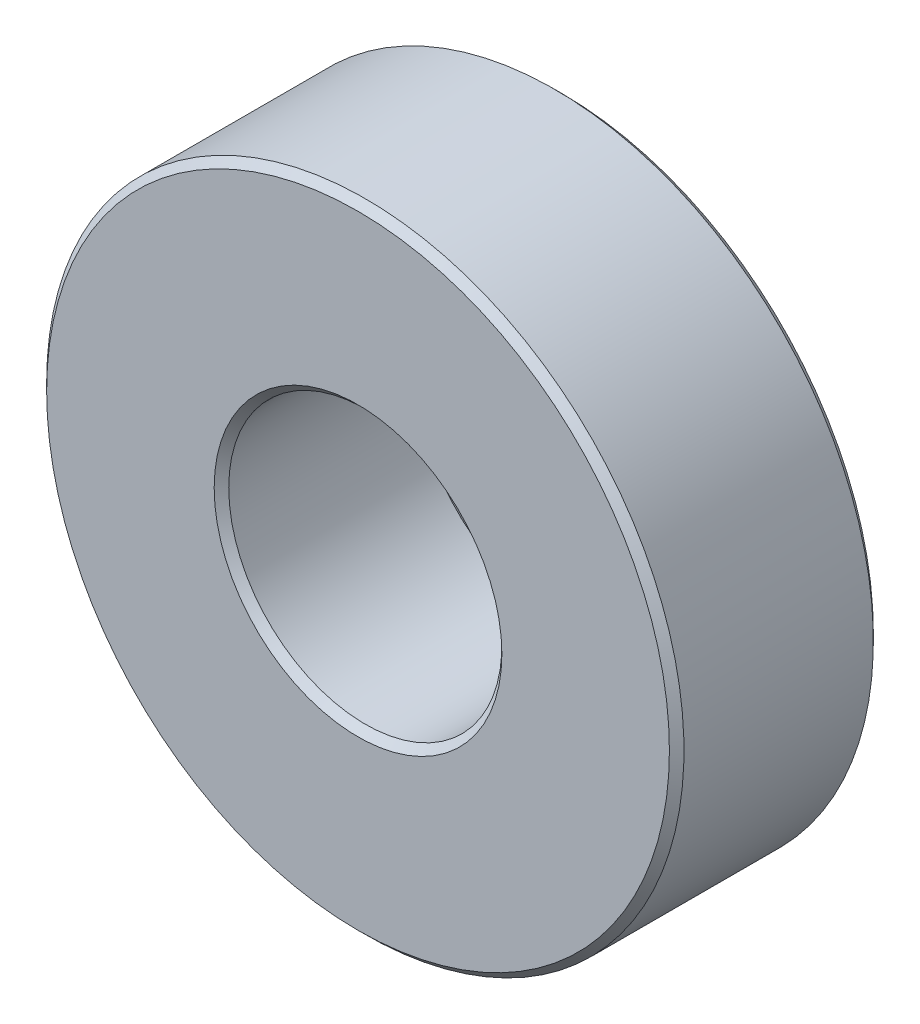
ISO-10303-21;
HEADER;
FILE_DESCRIPTION(('STEP AP214'),'2;1');
FILE_NAME('part.step','',(''),(''),'','','');
FILE_SCHEMA(('AUTOMOTIVE_DESIGN { 1 0 10303 214 1 1 1 1 }'));
ENDSEC;
DATA;
#1=APPLICATION_CONTEXT('core data for automotive mechanical design processes');
#2=APPLICATION_PROTOCOL_DEFINITION('international standard','automotive_design',2000,#1);
#3=PRODUCT_CONTEXT('',#1,'mechanical');
#4=PRODUCT('Part','Part','',(#3));
#5=PRODUCT_RELATED_PRODUCT_CATEGORY('part','',(#4));
#6=PRODUCT_DEFINITION_FORMATION('','',#4);
#7=PRODUCT_DEFINITION_CONTEXT('part definition',#1,'design');
#8=PRODUCT_DEFINITION('design','',#6,#7);
#9=PRODUCT_DEFINITION_SHAPE('','',#8);
#10=(LENGTH_UNIT() NAMED_UNIT(*) SI_UNIT(.MILLI.,.METRE.));
#11=(NAMED_UNIT(*) PLANE_ANGLE_UNIT() SI_UNIT($,.RADIAN.));
#12=(NAMED_UNIT(*) SI_UNIT($,.STERADIAN.) SOLID_ANGLE_UNIT());
#13=UNCERTAINTY_MEASURE_WITH_UNIT(LENGTH_MEASURE(1.E-05),#10,'distance_accuracy_value','');
#14=(GEOMETRIC_REPRESENTATION_CONTEXT(3) GLOBAL_UNCERTAINTY_ASSIGNED_CONTEXT((#13)) GLOBAL_UNIT_ASSIGNED_CONTEXT((#10,
#11,#12)) REPRESENTATION_CONTEXT('',''));
#15=CARTESIAN_POINT('',(0.,0.,0.));
#16=DIRECTION('',(0.,0.,1.));
#17=DIRECTION('',(1.,0.,0.));
#18=AXIS2_PLACEMENT_3D('',#15,#16,#17);
#19=CARTESIAN_POINT('',(0.,0.,7.112));
#20=DIRECTION('',(0.,0.,-1.));
#21=DIRECTION('',(-1.,0.,0.));
#22=AXIS2_PLACEMENT_3D('',#19,#20,#21);
#23=CYLINDRICAL_SURFACE('',#22,4.7625);
#24=CARTESIAN_POINT('',(0.,0.,0.254));
#25=DIRECTION('',(0.,0.,-1.));
#26=DIRECTION('',(-1.,0.,0.));
#27=AXIS2_PLACEMENT_3D('',#24,#25,#26);
#28=CIRCLE('',#27,4.7625);
#29=CARTESIAN_POINT('',(-4.7625,0.,0.254));
#30=VERTEX_POINT('',#29);
#31=EDGE_CURVE('E10',#30,#30,#28,.T.);
#32=ORIENTED_EDGE('',*,*,#31,.T.);
#33=EDGE_LOOP('',(#32));
#34=FACE_BOUND('',#33,.T.);
#35=CARTESIAN_POINT('',(0.,0.,6.858));
#36=DIRECTION('',(0.,0.,-1.));
#37=DIRECTION('',(-1.,0.,0.));
#38=AXIS2_PLACEMENT_3D('',#35,#36,#37);
#39=CIRCLE('',#38,4.7625);
#40=CARTESIAN_POINT('',(-4.7625,0.,6.858));
#41=VERTEX_POINT('',#40);
#42=EDGE_CURVE('E22',#41,#41,#39,.F.);
#43=ORIENTED_EDGE('',*,*,#42,.T.);
#44=EDGE_LOOP('',(#43));
#45=FACE_BOUND('',#44,.T.);
#46=ADVANCED_FACE('F14',(#34,#45),#23,.F.);
#47=CARTESIAN_POINT('',(0.,0.,7.112));
#48=DIRECTION('',(0.,0.,-1.));
#49=DIRECTION('',(-1.,0.,0.));
#50=AXIS2_PLACEMENT_3D('',#47,#48,#49);
#51=CYLINDRICAL_SURFACE('',#50,11.1125);
#52=CARTESIAN_POINT('',(0.,0.,0.254));
#53=DIRECTION('',(0.,0.,-1.));
#54=DIRECTION('',(-1.,0.,0.));
#55=AXIS2_PLACEMENT_3D('',#52,#53,#54);
#56=CIRCLE('',#55,11.1125);
#57=CARTESIAN_POINT('',(-11.1125,0.,0.254));
#58=VERTEX_POINT('',#57);
#59=EDGE_CURVE('E42',#58,#58,#56,.F.);
#60=ORIENTED_EDGE('',*,*,#59,.T.);
#61=EDGE_LOOP('',(#60));
#62=FACE_BOUND('',#61,.T.);
#63=CARTESIAN_POINT('',(0.,0.,6.858));
#64=DIRECTION('',(0.,0.,-1.));
#65=DIRECTION('',(-1.,0.,0.));
#66=AXIS2_PLACEMENT_3D('',#63,#64,#65);
#67=CIRCLE('',#66,11.1125);
#68=CARTESIAN_POINT('',(-11.1125,0.,6.858));
#69=VERTEX_POINT('',#68);
#70=EDGE_CURVE('E46',#69,#69,#67,.T.);
#71=ORIENTED_EDGE('',*,*,#70,.T.);
#72=EDGE_LOOP('',(#71));
#73=FACE_BOUND('',#72,.T.);
#74=ADVANCED_FACE('F16',(#62,#73),#51,.T.);
#75=CARTESIAN_POINT('',(0.,0.,7.112));
#76=DIRECTION('',(0.,0.,-1.));
#77=DIRECTION('',(-1.,0.,0.));
#78=AXIS2_PLACEMENT_3D('',#75,#76,#77);
#79=PLANE('',#78);
#80=CARTESIAN_POINT('',(0.,0.,7.112));
#81=DIRECTION('',(0.,0.,-1.));
#82=DIRECTION('',(-1.,0.,0.));
#83=AXIS2_PLACEMENT_3D('',#80,#81,#82);
#84=CIRCLE('',#83,10.8585);
#85=CARTESIAN_POINT('',(-10.8585,0.,7.112));
#86=VERTEX_POINT('',#85);
#87=EDGE_CURVE('E30',#86,#86,#84,.F.);
#88=ORIENTED_EDGE('',*,*,#87,.T.);
#89=EDGE_LOOP('',(#88));
#90=FACE_BOUND('',#89,.T.);
#91=CARTESIAN_POINT('',(0.,0.,7.112));
#92=DIRECTION('',(0.,0.,-1.));
#93=DIRECTION('',(-1.,0.,0.));
#94=AXIS2_PLACEMENT_3D('',#91,#92,#93);
#95=CIRCLE('',#94,5.0165);
#96=CARTESIAN_POINT('',(-5.0165,0.,7.112));
#97=VERTEX_POINT('',#96);
#98=EDGE_CURVE('E36',#97,#97,#95,.T.);
#99=ORIENTED_EDGE('',*,*,#98,.T.);
#100=EDGE_LOOP('',(#99));
#101=FACE_BOUND('',#100,.T.);
#102=ADVANCED_FACE('F78',(#90,#101),#79,.F.);
#103=CARTESIAN_POINT('',(0.,0.,0.));
#104=DIRECTION('',(0.,0.,-1.));
#105=DIRECTION('',(-1.,0.,0.));
#106=AXIS2_PLACEMENT_3D('',#103,#104,#105);
#107=PLANE('',#106);
#108=CARTESIAN_POINT('',(0.,0.,0.));
#109=DIRECTION('',(0.,0.,-1.));
#110=DIRECTION('',(-1.,0.,0.));
#111=AXIS2_PLACEMENT_3D('',#108,#109,#110);
#112=CIRCLE('',#111,10.8585);
#113=CARTESIAN_POINT('',(-10.8585,0.,0.));
#114=VERTEX_POINT('',#113);
#115=EDGE_CURVE('E49',#114,#114,#112,.T.);
#116=ORIENTED_EDGE('',*,*,#115,.T.);
#117=EDGE_LOOP('',(#116));
#118=FACE_BOUND('',#117,.T.);
#119=CARTESIAN_POINT('',(0.,0.,0.));
#120=DIRECTION('',(0.,0.,-1.));
#121=DIRECTION('',(-1.,0.,0.));
#122=AXIS2_PLACEMENT_3D('',#119,#120,#121);
#123=CIRCLE('',#122,5.0165);
#124=CARTESIAN_POINT('',(-5.0165,0.,0.));
#125=VERTEX_POINT('',#124);
#126=EDGE_CURVE('E52',#125,#125,#123,.F.);
#127=ORIENTED_EDGE('',*,*,#126,.T.);
#128=EDGE_LOOP('',(#127));
#129=FACE_BOUND('',#128,.T.);
#130=ADVANCED_FACE('F56',(#118,#129),#107,.T.);
#131=CARTESIAN_POINT('',(0.,0.,0.));
#132=DIRECTION('',(0.,0.,1.));
#133=DIRECTION('',(1.,0.,0.));
#134=AXIS2_PLACEMENT_3D('',#131,#132,#133);
#135=CONICAL_SURFACE('',#134,10.8585,0.78539816339745);
#136=ORIENTED_EDGE('',*,*,#59,.F.);
#137=EDGE_LOOP('',(#136));
#138=FACE_BOUND('',#137,.T.);
#139=ORIENTED_EDGE('',*,*,#115,.F.);
#140=EDGE_LOOP('',(#139));
#141=FACE_BOUND('',#140,.T.);
#142=ADVANCED_FACE('F71',(#138,#141),#135,.T.);
#143=CARTESIAN_POINT('',(0.,0.,6.858));
#144=DIRECTION('',(0.,0.,-1.));
#145=DIRECTION('',(-1.,0.,0.));
#146=AXIS2_PLACEMENT_3D('',#143,#144,#145);
#147=CONICAL_SURFACE('',#146,11.1125,0.78539816339745);
#148=ORIENTED_EDGE('',*,*,#87,.F.);
#149=EDGE_LOOP('',(#148));
#150=FACE_BOUND('',#149,.T.);
#151=ORIENTED_EDGE('',*,*,#70,.F.);
#152=EDGE_LOOP('',(#151));
#153=FACE_BOUND('',#152,.T.);
#154=ADVANCED_FACE('F62',(#150,#153),#147,.T.);
#155=CARTESIAN_POINT('',(0.,0.,0.254));
#156=DIRECTION('',(0.,0.,-1.));
#157=DIRECTION('',(-1.,0.,0.));
#158=AXIS2_PLACEMENT_3D('',#155,#156,#157);
#159=CONICAL_SURFACE('',#158,4.7625,0.785398163397448);
#160=ORIENTED_EDGE('',*,*,#126,.F.);
#161=EDGE_LOOP('',(#160));
#162=FACE_BOUND('',#161,.T.);
#163=ORIENTED_EDGE('',*,*,#31,.F.);
#164=EDGE_LOOP('',(#163));
#165=FACE_BOUND('',#164,.T.);
#166=ADVANCED_FACE('F58',(#162,#165),#159,.F.);
#167=CARTESIAN_POINT('',(0.,0.,7.112));
#168=DIRECTION('',(0.,0.,1.));
#169=DIRECTION('',(1.,0.,0.));
#170=AXIS2_PLACEMENT_3D('',#167,#168,#169);
#171=CONICAL_SURFACE('',#170,5.0165,0.785398163397448);
#172=ORIENTED_EDGE('',*,*,#42,.F.);
#173=EDGE_LOOP('',(#172));
#174=FACE_BOUND('',#173,.T.);
#175=ORIENTED_EDGE('',*,*,#98,.F.);
#176=EDGE_LOOP('',(#175));
#177=FACE_BOUND('',#176,.T.);
#178=ADVANCED_FACE('F61',(#174,#177),#171,.F.);
#179=CLOSED_SHELL('',(#46,#74,#102,#130,#142,#154,#166,#178));
#180=MANIFOLD_SOLID_BREP('B1',#179);
#181=ADVANCED_BREP_SHAPE_REPRESENTATION('',(#18,#180),#14);
#182=SHAPE_DEFINITION_REPRESENTATION(#9,#181);
ENDSEC;
END-ISO-10303-21;
